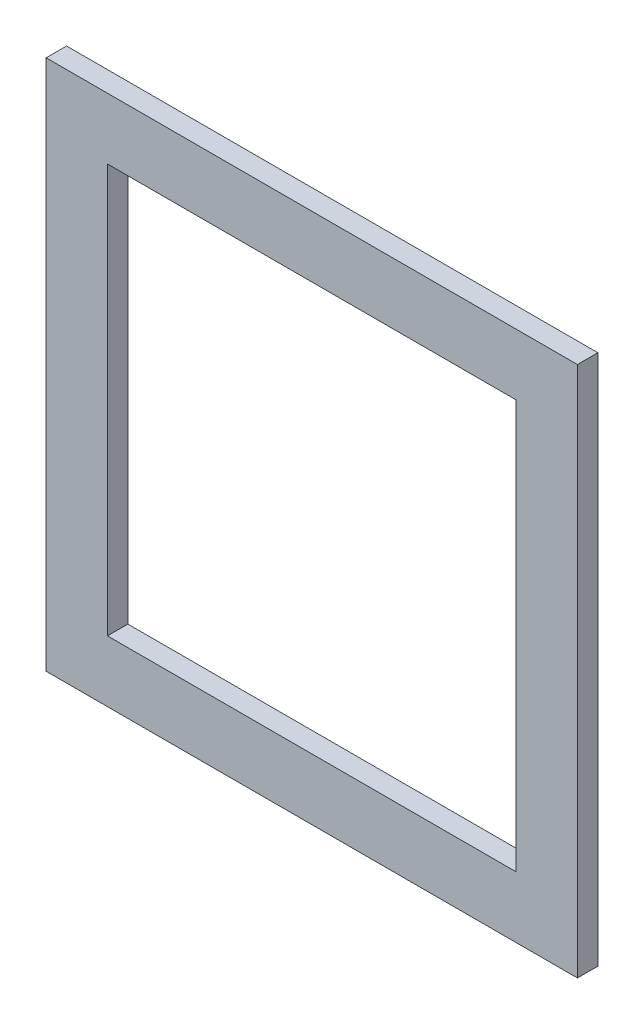
ISO-10303-21;
HEADER;
FILE_DESCRIPTION(('STEP AP214'),'2;1');
FILE_NAME('part.step','',(''),(''),'','','');
FILE_SCHEMA(('AUTOMOTIVE_DESIGN { 1 0 10303 214 1 1 1 1 }'));
ENDSEC;
DATA;
#1=APPLICATION_CONTEXT('core data for automotive mechanical design processes');
#2=APPLICATION_PROTOCOL_DEFINITION('international standard','automotive_design',2000,#1);
#3=PRODUCT_CONTEXT('',#1,'mechanical');
#4=PRODUCT('Part','Part','',(#3));
#5=PRODUCT_RELATED_PRODUCT_CATEGORY('part','',(#4));
#6=PRODUCT_DEFINITION_FORMATION('','',#4);
#7=PRODUCT_DEFINITION_CONTEXT('part definition',#1,'design');
#8=PRODUCT_DEFINITION('design','',#6,#7);
#9=PRODUCT_DEFINITION_SHAPE('','',#8);
#10=(LENGTH_UNIT() NAMED_UNIT(*) SI_UNIT(.MILLI.,.METRE.));
#11=(NAMED_UNIT(*) PLANE_ANGLE_UNIT() SI_UNIT($,.RADIAN.));
#12=(NAMED_UNIT(*) SI_UNIT($,.STERADIAN.) SOLID_ANGLE_UNIT());
#13=UNCERTAINTY_MEASURE_WITH_UNIT(LENGTH_MEASURE(1.E-05),#10,'distance_accuracy_value','');
#14=(GEOMETRIC_REPRESENTATION_CONTEXT(3) GLOBAL_UNCERTAINTY_ASSIGNED_CONTEXT((#13)) GLOBAL_UNIT_ASSIGNED_CONTEXT((#10,
#11,#12)) REPRESENTATION_CONTEXT('',''));
#15=CARTESIAN_POINT('',(0.,0.,0.));
#16=DIRECTION('',(0.,0.,1.));
#17=DIRECTION('',(1.,0.,0.));
#18=AXIS2_PLACEMENT_3D('',#15,#16,#17);
#19=CARTESIAN_POINT('',(-65.,65.,5.));
#20=DIRECTION('',(1.,0.,0.));
#21=DIRECTION('',(0.,1.,0.));
#22=AXIS2_PLACEMENT_3D('',#19,#20,#21);
#23=PLANE('',#22);
#24=DIRECTION('',(0.,-1.,0.));
#25=VECTOR('',#24,1.);
#26=CARTESIAN_POINT('',(-65.,65.,0.));
#27=LINE('',#26,#25);
#28=CARTESIAN_POINT('',(-65.,65.,0.));
#29=VERTEX_POINT('',#28);
#30=CARTESIAN_POINT('',(-65.,-65.,0.));
#31=VERTEX_POINT('',#30);
#32=EDGE_CURVE('E132',#29,#31,#27,.T.);
#33=ORIENTED_EDGE('',*,*,#32,.T.);
#34=DIRECTION('',(0.,0.,-1.));
#35=VECTOR('',#34,1.);
#36=CARTESIAN_POINT('',(-65.,-65.,5.));
#37=LINE('',#36,#35);
#38=CARTESIAN_POINT('',(-65.,-65.,5.));
#39=VERTEX_POINT('',#38);
#40=EDGE_CURVE('E11',#39,#31,#37,.T.);
#41=ORIENTED_EDGE('',*,*,#40,.F.);
#42=DIRECTION('',(0.,-1.,0.));
#43=VECTOR('',#42,1.);
#44=CARTESIAN_POINT('',(-65.,65.,5.));
#45=LINE('',#44,#43);
#46=CARTESIAN_POINT('',(-65.,65.,5.));
#47=VERTEX_POINT('',#46);
#48=EDGE_CURVE('E136',#47,#39,#45,.T.);
#49=ORIENTED_EDGE('',*,*,#48,.F.);
#50=DIRECTION('',(0.,0.,-1.));
#51=VECTOR('',#50,1.);
#52=CARTESIAN_POINT('',(-65.,65.,5.));
#53=LINE('',#52,#51);
#54=EDGE_CURVE('E146',#47,#29,#53,.T.);
#55=ORIENTED_EDGE('',*,*,#54,.T.);
#56=EDGE_LOOP('',(#33,#41,#49,#55));
#57=FACE_BOUND('',#56,.T.);
#58=ADVANCED_FACE('F35',(#57),#23,.F.);
#59=CARTESIAN_POINT('',(65.,-65.,5.));
#60=DIRECTION('',(0.,1.,0.));
#61=DIRECTION('',(-1.,0.,0.));
#62=AXIS2_PLACEMENT_3D('',#59,#60,#61);
#63=PLANE('',#62);
#64=DIRECTION('',(1.,0.,0.));
#65=VECTOR('',#64,1.);
#66=CARTESIAN_POINT('',(65.,-65.,0.));
#67=LINE('',#66,#65);
#68=CARTESIAN_POINT('',(65.,-65.,0.));
#69=VERTEX_POINT('',#68);
#70=EDGE_CURVE('E149',#31,#69,#67,.T.);
#71=ORIENTED_EDGE('',*,*,#70,.T.);
#72=DIRECTION('',(0.,0.,-1.));
#73=VECTOR('',#72,1.);
#74=CARTESIAN_POINT('',(65.,-65.,5.));
#75=LINE('',#74,#73);
#76=CARTESIAN_POINT('',(65.,-65.,5.));
#77=VERTEX_POINT('',#76);
#78=EDGE_CURVE('E42',#77,#69,#75,.T.);
#79=ORIENTED_EDGE('',*,*,#78,.F.);
#80=DIRECTION('',(1.,0.,0.));
#81=VECTOR('',#80,1.);
#82=CARTESIAN_POINT('',(65.,-65.,5.));
#83=LINE('',#82,#81);
#84=EDGE_CURVE('E139',#39,#77,#83,.T.);
#85=ORIENTED_EDGE('',*,*,#84,.F.);
#86=ORIENTED_EDGE('',*,*,#40,.T.);
#87=EDGE_LOOP('',(#71,#79,#85,#86));
#88=FACE_BOUND('',#87,.T.);
#89=ADVANCED_FACE('F177',(#88),#63,.F.);
#90=CARTESIAN_POINT('',(65.,65.,5.));
#91=DIRECTION('',(-1.,0.,0.));
#92=DIRECTION('',(0.,-1.,0.));
#93=AXIS2_PLACEMENT_3D('',#90,#91,#92);
#94=PLANE('',#93);
#95=DIRECTION('',(0.,1.,0.));
#96=VECTOR('',#95,1.);
#97=CARTESIAN_POINT('',(65.,65.,0.));
#98=LINE('',#97,#96);
#99=CARTESIAN_POINT('',(65.,65.,0.));
#100=VERTEX_POINT('',#99);
#101=EDGE_CURVE('E151',#69,#100,#98,.T.);
#102=ORIENTED_EDGE('',*,*,#101,.T.);
#103=DIRECTION('',(0.,0.,-1.));
#104=VECTOR('',#103,1.);
#105=CARTESIAN_POINT('',(65.,65.,5.));
#106=LINE('',#105,#104);
#107=CARTESIAN_POINT('',(65.,65.,5.));
#108=VERTEX_POINT('',#107);
#109=EDGE_CURVE('E156',#108,#100,#106,.T.);
#110=ORIENTED_EDGE('',*,*,#109,.F.);
#111=DIRECTION('',(0.,1.,0.));
#112=VECTOR('',#111,1.);
#113=CARTESIAN_POINT('',(65.,65.,5.));
#114=LINE('',#113,#112);
#115=EDGE_CURVE('E142',#77,#108,#114,.T.);
#116=ORIENTED_EDGE('',*,*,#115,.F.);
#117=ORIENTED_EDGE('',*,*,#78,.T.);
#118=EDGE_LOOP('',(#102,#110,#116,#117));
#119=FACE_BOUND('',#118,.T.);
#120=ADVANCED_FACE('F163',(#119),#94,.F.);
#121=CARTESIAN_POINT('',(65.,65.,5.));
#122=DIRECTION('',(0.,-1.,0.));
#123=DIRECTION('',(1.,0.,0.));
#124=AXIS2_PLACEMENT_3D('',#121,#122,#123);
#125=PLANE('',#124);
#126=DIRECTION('',(-1.,0.,0.));
#127=VECTOR('',#126,1.);
#128=CARTESIAN_POINT('',(65.,65.,0.));
#129=LINE('',#128,#127);
#130=EDGE_CURVE('E140',#100,#29,#129,.T.);
#131=ORIENTED_EDGE('',*,*,#130,.T.);
#132=ORIENTED_EDGE('',*,*,#54,.F.);
#133=DIRECTION('',(-1.,0.,0.));
#134=VECTOR('',#133,1.);
#135=CARTESIAN_POINT('',(65.,65.,5.));
#136=LINE('',#135,#134);
#137=EDGE_CURVE('E144',#108,#47,#136,.T.);
#138=ORIENTED_EDGE('',*,*,#137,.F.);
#139=ORIENTED_EDGE('',*,*,#109,.T.);
#140=EDGE_LOOP('',(#131,#132,#138,#139));
#141=FACE_BOUND('',#140,.T.);
#142=ADVANCED_FACE('F170',(#141),#125,.F.);
#143=CARTESIAN_POINT('',(0.,0.,5.));
#144=DIRECTION('',(0.,0.,-1.));
#145=DIRECTION('',(-1.,0.,0.));
#146=AXIS2_PLACEMENT_3D('',#143,#144,#145);
#147=PLANE('',#146);
#148=DIRECTION('',(1.,0.,0.));
#149=VECTOR('',#148,1.);
#150=CARTESIAN_POINT('',(50.,-50.,5.));
#151=LINE('',#150,#149);
#152=CARTESIAN_POINT('',(-50.,-50.,5.));
#153=VERTEX_POINT('',#152);
#154=CARTESIAN_POINT('',(50.,-50.,5.));
#155=VERTEX_POINT('',#154);
#156=EDGE_CURVE('E126',#153,#155,#151,.T.);
#157=ORIENTED_EDGE('',*,*,#156,.F.);
#158=DIRECTION('',(0.,-1.,0.));
#159=VECTOR('',#158,1.);
#160=CARTESIAN_POINT('',(-50.,50.,5.));
#161=LINE('',#160,#159);
#162=CARTESIAN_POINT('',(-50.,50.,5.));
#163=VERTEX_POINT('',#162);
#164=EDGE_CURVE('E49',#163,#153,#161,.T.);
#165=ORIENTED_EDGE('',*,*,#164,.F.);
#166=DIRECTION('',(-1.,0.,0.));
#167=VECTOR('',#166,1.);
#168=CARTESIAN_POINT('',(50.,50.,5.));
#169=LINE('',#168,#167);
#170=CARTESIAN_POINT('',(50.,50.,5.));
#171=VERTEX_POINT('',#170);
#172=EDGE_CURVE('E117',#171,#163,#169,.T.);
#173=ORIENTED_EDGE('',*,*,#172,.F.);
#174=DIRECTION('',(0.,1.,0.));
#175=VECTOR('',#174,1.);
#176=CARTESIAN_POINT('',(50.,50.,5.));
#177=LINE('',#176,#175);
#178=EDGE_CURVE('E120',#155,#171,#177,.T.);
#179=ORIENTED_EDGE('',*,*,#178,.F.);
#180=EDGE_LOOP('',(#157,#165,#173,#179));
#181=FACE_BOUND('',#180,.T.);
#182=ORIENTED_EDGE('',*,*,#48,.T.);
#183=ORIENTED_EDGE('',*,*,#84,.T.);
#184=ORIENTED_EDGE('',*,*,#115,.T.);
#185=ORIENTED_EDGE('',*,*,#137,.T.);
#186=EDGE_LOOP('',(#182,#183,#184,#185));
#187=FACE_BOUND('',#186,.T.);
#188=ADVANCED_FACE('F176',(#181,#187),#147,.F.);
#189=CARTESIAN_POINT('',(0.,0.,0.));
#190=DIRECTION('',(0.,0.,-1.));
#191=DIRECTION('',(-1.,0.,0.));
#192=AXIS2_PLACEMENT_3D('',#189,#190,#191);
#193=PLANE('',#192);
#194=DIRECTION('',(0.,-1.,0.));
#195=VECTOR('',#194,1.);
#196=CARTESIAN_POINT('',(-50.,50.,0.));
#197=LINE('',#196,#195);
#198=CARTESIAN_POINT('',(-50.,50.,0.));
#199=VERTEX_POINT('',#198);
#200=CARTESIAN_POINT('',(-50.,-50.,0.));
#201=VERTEX_POINT('',#200);
#202=EDGE_CURVE('E101',#199,#201,#197,.T.);
#203=ORIENTED_EDGE('',*,*,#202,.T.);
#204=DIRECTION('',(1.,0.,0.));
#205=VECTOR('',#204,1.);
#206=CARTESIAN_POINT('',(50.,-50.,0.));
#207=LINE('',#206,#205);
#208=CARTESIAN_POINT('',(50.,-50.,0.));
#209=VERTEX_POINT('',#208);
#210=EDGE_CURVE('E110',#201,#209,#207,.T.);
#211=ORIENTED_EDGE('',*,*,#210,.T.);
#212=DIRECTION('',(0.,1.,0.));
#213=VECTOR('',#212,1.);
#214=CARTESIAN_POINT('',(50.,50.,0.));
#215=LINE('',#214,#213);
#216=CARTESIAN_POINT('',(50.,50.,0.));
#217=VERTEX_POINT('',#216);
#218=EDGE_CURVE('E57',#209,#217,#215,.T.);
#219=ORIENTED_EDGE('',*,*,#218,.T.);
#220=DIRECTION('',(-1.,0.,0.));
#221=VECTOR('',#220,1.);
#222=CARTESIAN_POINT('',(50.,50.,0.));
#223=LINE('',#222,#221);
#224=EDGE_CURVE('E107',#217,#199,#223,.T.);
#225=ORIENTED_EDGE('',*,*,#224,.T.);
#226=EDGE_LOOP('',(#203,#211,#219,#225));
#227=FACE_BOUND('',#226,.T.);
#228=ORIENTED_EDGE('',*,*,#32,.F.);
#229=ORIENTED_EDGE('',*,*,#130,.F.);
#230=ORIENTED_EDGE('',*,*,#101,.F.);
#231=ORIENTED_EDGE('',*,*,#70,.F.);
#232=EDGE_LOOP('',(#228,#229,#230,#231));
#233=FACE_BOUND('',#232,.T.);
#234=ADVANCED_FACE('F114',(#227,#233),#193,.T.);
#235=CARTESIAN_POINT('',(-50.,50.,0.));
#236=DIRECTION('',(-1.,0.,0.));
#237=DIRECTION('',(0.,0.,1.));
#238=AXIS2_PLACEMENT_3D('',#235,#236,#237);
#239=PLANE('',#238);
#240=ORIENTED_EDGE('',*,*,#164,.T.);
#241=DIRECTION('',(0.,0.,1.));
#242=VECTOR('',#241,1.);
#243=CARTESIAN_POINT('',(-50.,-50.,0.));
#244=LINE('',#243,#242);
#245=EDGE_CURVE('E97',#201,#153,#244,.T.);
#246=ORIENTED_EDGE('',*,*,#245,.F.);
#247=ORIENTED_EDGE('',*,*,#202,.F.);
#248=DIRECTION('',(0.,0.,1.));
#249=VECTOR('',#248,1.);
#250=CARTESIAN_POINT('',(-50.,50.,0.));
#251=LINE('',#250,#249);
#252=EDGE_CURVE('E130',#199,#163,#251,.T.);
#253=ORIENTED_EDGE('',*,*,#252,.T.);
#254=EDGE_LOOP('',(#240,#246,#247,#253));
#255=FACE_BOUND('',#254,.T.);
#256=ADVANCED_FACE('F99',(#255),#239,.F.);
#257=CARTESIAN_POINT('',(50.,50.,0.));
#258=DIRECTION('',(0.,1.,0.));
#259=DIRECTION('',(0.,0.,1.));
#260=AXIS2_PLACEMENT_3D('',#257,#258,#259);
#261=PLANE('',#260);
#262=ORIENTED_EDGE('',*,*,#172,.T.);
#263=ORIENTED_EDGE('',*,*,#252,.F.);
#264=ORIENTED_EDGE('',*,*,#224,.F.);
#265=DIRECTION('',(0.,0.,1.));
#266=VECTOR('',#265,1.);
#267=CARTESIAN_POINT('',(50.,50.,0.));
#268=LINE('',#267,#266);
#269=EDGE_CURVE('E133',#217,#171,#268,.T.);
#270=ORIENTED_EDGE('',*,*,#269,.T.);
#271=EDGE_LOOP('',(#262,#263,#264,#270));
#272=FACE_BOUND('',#271,.T.);
#273=ADVANCED_FACE('F194',(#272),#261,.F.);
#274=CARTESIAN_POINT('',(50.,50.,0.));
#275=DIRECTION('',(1.,0.,0.));
#276=DIRECTION('',(0.,0.,-1.));
#277=AXIS2_PLACEMENT_3D('',#274,#275,#276);
#278=PLANE('',#277);
#279=ORIENTED_EDGE('',*,*,#178,.T.);
#280=ORIENTED_EDGE('',*,*,#269,.F.);
#281=ORIENTED_EDGE('',*,*,#218,.F.);
#282=DIRECTION('',(0.,0.,1.));
#283=VECTOR('',#282,1.);
#284=CARTESIAN_POINT('',(50.,-50.,0.));
#285=LINE('',#284,#283);
#286=EDGE_CURVE('E106',#209,#155,#285,.T.);
#287=ORIENTED_EDGE('',*,*,#286,.T.);
#288=EDGE_LOOP('',(#279,#280,#281,#287));
#289=FACE_BOUND('',#288,.T.);
#290=ADVANCED_FACE('F197',(#289),#278,.F.);
#291=CARTESIAN_POINT('',(50.,-50.,0.));
#292=DIRECTION('',(0.,-1.,0.));
#293=DIRECTION('',(0.,0.,-1.));
#294=AXIS2_PLACEMENT_3D('',#291,#292,#293);
#295=PLANE('',#294);
#296=ORIENTED_EDGE('',*,*,#156,.T.);
#297=ORIENTED_EDGE('',*,*,#286,.F.);
#298=ORIENTED_EDGE('',*,*,#210,.F.);
#299=ORIENTED_EDGE('',*,*,#245,.T.);
#300=EDGE_LOOP('',(#296,#297,#298,#299));
#301=FACE_BOUND('',#300,.T.);
#302=ADVANCED_FACE('F111',(#301),#295,.F.);
#303=CLOSED_SHELL('',(#58,#89,#120,#142,#188,#234,#256,#273,#290,#302));
#304=MANIFOLD_SOLID_BREP('B2',#303);
#305=ADVANCED_BREP_SHAPE_REPRESENTATION('',(#18,#304),#14);
#306=SHAPE_DEFINITION_REPRESENTATION(#9,#305);
ENDSEC;
END-ISO-10303-21;
